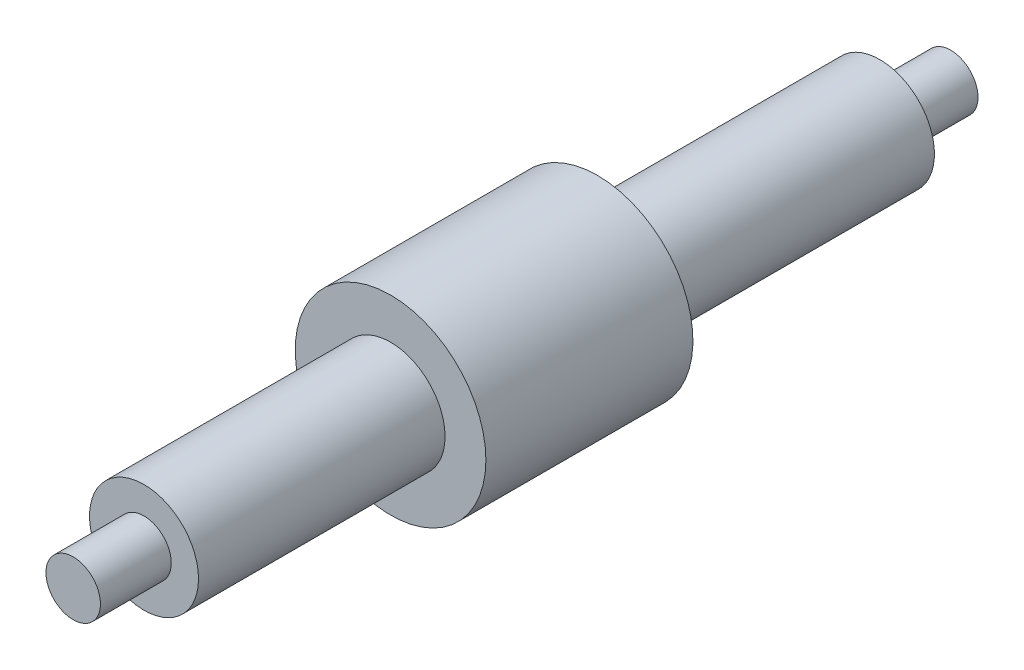
ISO-10303-21;
HEADER;
FILE_DESCRIPTION(('STEP AP214'),'2;1');
FILE_NAME('part.step','',(''),(''),'','','');
FILE_SCHEMA(('AUTOMOTIVE_DESIGN { 1 0 10303 214 1 1 1 1 }'));
ENDSEC;
DATA;
#1=APPLICATION_CONTEXT('core data for automotive mechanical design processes');
#2=APPLICATION_PROTOCOL_DEFINITION('international standard','automotive_design',2000,#1);
#3=PRODUCT_CONTEXT('',#1,'mechanical');
#4=PRODUCT('Part','Part','',(#3));
#5=PRODUCT_RELATED_PRODUCT_CATEGORY('part','',(#4));
#6=PRODUCT_DEFINITION_FORMATION('','',#4);
#7=PRODUCT_DEFINITION_CONTEXT('part definition',#1,'design');
#8=PRODUCT_DEFINITION('design','',#6,#7);
#9=PRODUCT_DEFINITION_SHAPE('','',#8);
#10=(LENGTH_UNIT() NAMED_UNIT(*) SI_UNIT(.MILLI.,.METRE.));
#11=(NAMED_UNIT(*) PLANE_ANGLE_UNIT() SI_UNIT($,.RADIAN.));
#12=(NAMED_UNIT(*) SI_UNIT($,.STERADIAN.) SOLID_ANGLE_UNIT());
#13=UNCERTAINTY_MEASURE_WITH_UNIT(LENGTH_MEASURE(1.E-05),#10,'distance_accuracy_value','');
#14=(GEOMETRIC_REPRESENTATION_CONTEXT(3) GLOBAL_UNCERTAINTY_ASSIGNED_CONTEXT((#13)) GLOBAL_UNIT_ASSIGNED_CONTEXT((#10,
#11,#12)) REPRESENTATION_CONTEXT('',''));
#15=CARTESIAN_POINT('',(0.,0.,0.));
#16=DIRECTION('',(0.,0.,1.));
#17=DIRECTION('',(1.,0.,0.));
#18=AXIS2_PLACEMENT_3D('',#15,#16,#17);
#19=CARTESIAN_POINT('',(0.,0.,37.4716720843421));
#20=DIRECTION('',(0.,0.,-1.));
#21=DIRECTION('',(-1.,0.,0.));
#22=AXIS2_PLACEMENT_3D('',#19,#20,#21);
#23=CYLINDRICAL_SURFACE('',#22,2.);
#24=CARTESIAN_POINT('',(0.,0.,22.7648178348497));
#25=DIRECTION('',(0.,0.,1.));
#26=DIRECTION('',(1.,0.,0.));
#27=AXIS2_PLACEMENT_3D('',#24,#25,#26);
#28=CIRCLE('',#27,2.);
#29=CARTESIAN_POINT('',(2.,0.,22.7648178348497));
#30=VERTEX_POINT('',#29);
#31=EDGE_CURVE('E10',#30,#30,#28,.F.);
#32=ORIENTED_EDGE('',*,*,#31,.F.);
#33=EDGE_LOOP('',(#32));
#34=FACE_BOUND('',#33,.T.);
#35=CARTESIAN_POINT('',(0.,0.,31.8148178348497));
#36=DIRECTION('',(0.,0.,1.));
#37=DIRECTION('',(1.,0.,0.));
#38=AXIS2_PLACEMENT_3D('',#35,#36,#37);
#39=CIRCLE('',#38,2.);
#40=CARTESIAN_POINT('',(2.,0.,31.8148178348497));
#41=VERTEX_POINT('',#40);
#42=EDGE_CURVE('E56',#41,#41,#39,.F.);
#43=ORIENTED_EDGE('',*,*,#42,.T.);
#44=EDGE_LOOP('',(#43));
#45=FACE_BOUND('',#44,.T.);
#46=ADVANCED_FACE('F37',(#34,#45),#23,.T.);
#47=CARTESIAN_POINT('',(0.,0.,31.8148178348497));
#48=DIRECTION('',(0.,0.,1.));
#49=DIRECTION('',(0.99775837000302,-0.066919616622608,0.));
#50=AXIS2_PLACEMENT_3D('',#47,#48,#49);
#51=PLANE('',#50);
#52=CARTESIAN_POINT('',(0.,0.,31.8148178348497));
#53=DIRECTION('',(0.,0.,1.));
#54=DIRECTION('',(1.,0.,0.));
#55=AXIS2_PLACEMENT_3D('',#52,#53,#54);
#56=CIRCLE('',#55,1.);
#57=CARTESIAN_POINT('',(1.,0.,31.8148178348497));
#58=VERTEX_POINT('',#57);
#59=EDGE_CURVE('E53',#58,#58,#56,.T.);
#60=ORIENTED_EDGE('',*,*,#59,.F.);
#61=EDGE_LOOP('',(#60));
#62=FACE_BOUND('',#61,.T.);
#63=ORIENTED_EDGE('',*,*,#42,.F.);
#64=EDGE_LOOP('',(#63));
#65=FACE_BOUND('',#64,.T.);
#66=ADVANCED_FACE('F39',(#62,#65),#51,.T.);
#67=CARTESIAN_POINT('',(0.,0.,37.2432449595959));
#68=DIRECTION('',(0.,0.,-1.));
#69=DIRECTION('',(-1.,0.,0.));
#70=AXIS2_PLACEMENT_3D('',#67,#68,#69);
#71=CYLINDRICAL_SURFACE('',#70,1.);
#72=ORIENTED_EDGE('',*,*,#59,.T.);
#73=EDGE_LOOP('',(#72));
#74=FACE_BOUND('',#73,.T.);
#75=CARTESIAN_POINT('',(0.,0.,34.4148178348497));
#76=DIRECTION('',(0.,0.,1.));
#77=DIRECTION('',(1.,0.,0.));
#78=AXIS2_PLACEMENT_3D('',#75,#76,#77);
#79=CIRCLE('',#78,1.);
#80=CARTESIAN_POINT('',(1.,0.,34.4148178348497));
#81=VERTEX_POINT('',#80);
#82=EDGE_CURVE('E62',#81,#81,#79,.T.);
#83=ORIENTED_EDGE('',*,*,#82,.F.);
#84=EDGE_LOOP('',(#83));
#85=FACE_BOUND('',#84,.T.);
#86=ADVANCED_FACE('F98',(#74,#85),#71,.T.);
#87=CARTESIAN_POINT('',(-86.1707420082115,-97.3347702604888,34.4148178348497));
#88=DIRECTION('',(0.,0.,1.));
#89=DIRECTION('',(0.998801213811109,0.0489503349269011,0.));
#90=AXIS2_PLACEMENT_3D('',#87,#88,#89);
#91=PLANE('',#90);
#92=ORIENTED_EDGE('',*,*,#82,.T.);
#93=EDGE_LOOP('',(#92));
#94=FACE_BOUND('',#93,.T.);
#95=ADVANCED_FACE('F91',(#94),#91,.T.);
#96=CARTESIAN_POINT('',(0.,0.,22.7648178348497));
#97=DIRECTION('',(0.,0.,1.));
#98=DIRECTION('',(0.0489503349269012,-0.998801213811109,0.));
#99=AXIS2_PLACEMENT_3D('',#96,#97,#98);
#100=PLANE('',#99);
#101=ORIENTED_EDGE('',*,*,#31,.T.);
#102=EDGE_LOOP('',(#101));
#103=FACE_BOUND('',#102,.T.);
#104=CARTESIAN_POINT('',(0.,0.,22.7648178348497));
#105=DIRECTION('',(0.,0.,1.));
#106=DIRECTION('',(1.,0.,0.));
#107=AXIS2_PLACEMENT_3D('',#104,#105,#106);
#108=CIRCLE('',#107,3.5);
#109=CARTESIAN_POINT('',(3.5,0.,22.7648178348497));
#110=VERTEX_POINT('',#109);
#111=EDGE_CURVE('E72',#110,#110,#108,.F.);
#112=ORIENTED_EDGE('',*,*,#111,.F.);
#113=EDGE_LOOP('',(#112));
#114=FACE_BOUND('',#113,.T.);
#115=ADVANCED_FACE('F89',(#103,#114),#100,.T.);
#116=CARTESIAN_POINT('',(0.,0.,15.1648178348506));
#117=DIRECTION('',(0.,0.,-1.));
#118=DIRECTION('',(0.,1.,0.));
#119=AXIS2_PLACEMENT_3D('',#116,#117,#118);
#120=PLANE('',#119);
#121=CARTESIAN_POINT('',(0.,0.,15.1648178348506));
#122=DIRECTION('',(0.,0.,-1.));
#123=DIRECTION('',(0.,1.,0.));
#124=AXIS2_PLACEMENT_3D('',#121,#122,#123);
#125=CIRCLE('',#124,2.);
#126=CARTESIAN_POINT('',(0.,2.,15.1648178348507));
#127=VERTEX_POINT('',#126);
#128=EDGE_CURVE('E44',#127,#127,#125,.F.);
#129=ORIENTED_EDGE('',*,*,#128,.T.);
#130=EDGE_LOOP('',(#129));
#131=FACE_BOUND('',#130,.T.);
#132=CARTESIAN_POINT('',(0.,0.,15.1648178348506));
#133=DIRECTION('',(0.,0.,-1.));
#134=DIRECTION('',(0.,1.,0.));
#135=AXIS2_PLACEMENT_3D('',#132,#133,#134);
#136=CIRCLE('',#135,3.5);
#137=CARTESIAN_POINT('',(0.,3.5,15.1648178348507));
#138=VERTEX_POINT('',#137);
#139=EDGE_CURVE('E76',#138,#138,#136,.T.);
#140=ORIENTED_EDGE('',*,*,#139,.T.);
#141=EDGE_LOOP('',(#140));
#142=FACE_BOUND('',#141,.T.);
#143=ADVANCED_FACE('F80',(#131,#142),#120,.T.);
#144=CARTESIAN_POINT('',(0.,0.,32.6643127714613));
#145=DIRECTION('',(0.,0.,-1.));
#146=DIRECTION('',(-1.,0.,0.));
#147=AXIS2_PLACEMENT_3D('',#144,#145,#146);
#148=CYLINDRICAL_SURFACE('',#147,3.5);
#149=ORIENTED_EDGE('',*,*,#139,.F.);
#150=EDGE_LOOP('',(#149));
#151=FACE_BOUND('',#150,.T.);
#152=ORIENTED_EDGE('',*,*,#111,.T.);
#153=EDGE_LOOP('',(#152));
#154=FACE_BOUND('',#153,.T.);
#155=ADVANCED_FACE('F82',(#151,#154),#148,.T.);
#156=CARTESIAN_POINT('',(-86.1707420082115,-97.3347702604888,2.20128012348954));
#157=DIRECTION('',(0.,0.,1.));
#158=DIRECTION('',(0.998801213811109,0.0489503349269011,0.));
#159=AXIS2_PLACEMENT_3D('',#156,#157,#158);
#160=PLANE('',#159);
#161=CARTESIAN_POINT('',(0.,0.,2.20128012348954));
#162=DIRECTION('',(0.,0.,1.));
#163=DIRECTION('',(1.,0.,0.));
#164=AXIS2_PLACEMENT_3D('',#161,#162,#163);
#165=CIRCLE('',#164,1.);
#166=CARTESIAN_POINT('',(1.,0.,2.20128012348954));
#167=VERTEX_POINT('',#166);
#168=EDGE_CURVE('E66',#167,#167,#165,.T.);
#169=ORIENTED_EDGE('',*,*,#168,.F.);
#170=EDGE_LOOP('',(#169));
#171=FACE_BOUND('',#170,.T.);
#172=ADVANCED_FACE('F85',(#171),#160,.F.);
#173=CARTESIAN_POINT('',(0.,0.,-0.627147001256649));
#174=DIRECTION('',(0.,0.,1.));
#175=DIRECTION('',(1.,0.,0.));
#176=AXIS2_PLACEMENT_3D('',#173,#174,#175);
#177=CYLINDRICAL_SURFACE('',#176,1.);
#178=ORIENTED_EDGE('',*,*,#168,.T.);
#179=EDGE_LOOP('',(#178));
#180=FACE_BOUND('',#179,.T.);
#181=CARTESIAN_POINT('',(0.,0.,4.80128012348955));
#182=DIRECTION('',(0.,0.,-1.));
#183=DIRECTION('',(-1.,0.,0.));
#184=AXIS2_PLACEMENT_3D('',#181,#182,#183);
#185=CIRCLE('',#184,1.);
#186=CARTESIAN_POINT('',(-1.,0.,4.80128012348955));
#187=VERTEX_POINT('',#186);
#188=EDGE_CURVE('E48',#187,#187,#185,.T.);
#189=ORIENTED_EDGE('',*,*,#188,.T.);
#190=EDGE_LOOP('',(#189));
#191=FACE_BOUND('',#190,.T.);
#192=ADVANCED_FACE('F117',(#180,#191),#177,.T.);
#193=CARTESIAN_POINT('',(0.,0.,4.80128012348955));
#194=DIRECTION('',(0.,0.,-1.));
#195=DIRECTION('',(-1.,0.,0.));
#196=AXIS2_PLACEMENT_3D('',#193,#194,#195);
#197=PLANE('',#196);
#198=ORIENTED_EDGE('',*,*,#188,.F.);
#199=EDGE_LOOP('',(#198));
#200=FACE_BOUND('',#199,.T.);
#201=CARTESIAN_POINT('',(0.,0.,4.80128012348955));
#202=DIRECTION('',(0.,0.,-1.));
#203=DIRECTION('',(-1.,0.,0.));
#204=AXIS2_PLACEMENT_3D('',#201,#202,#203);
#205=CIRCLE('',#204,2.);
#206=CARTESIAN_POINT('',(-2.,0.,4.80128012348955));
#207=VERTEX_POINT('',#206);
#208=EDGE_CURVE('E59',#207,#207,#205,.T.);
#209=ORIENTED_EDGE('',*,*,#208,.T.);
#210=EDGE_LOOP('',(#209));
#211=FACE_BOUND('',#210,.T.);
#212=ADVANCED_FACE('F112',(#200,#211),#197,.T.);
#213=ORIENTED_EDGE('',*,*,#128,.F.);
#214=EDGE_LOOP('',(#213));
#215=FACE_BOUND('',#214,.T.);
#216=ORIENTED_EDGE('',*,*,#208,.F.);
#217=EDGE_LOOP('',(#216));
#218=FACE_BOUND('',#217,.T.);
#219=ADVANCED_FACE('F104',(#215,#218),#23,.T.);
#220=CLOSED_SHELL('',(#46,#66,#86,#95,#115,#143,#155,#172,#192,#212,#219));
#221=MANIFOLD_SOLID_BREP('B2',#220);
#222=ADVANCED_BREP_SHAPE_REPRESENTATION('',(#18,#221),#14);
#223=SHAPE_DEFINITION_REPRESENTATION(#9,#222);
ENDSEC;
END-ISO-10303-21;
